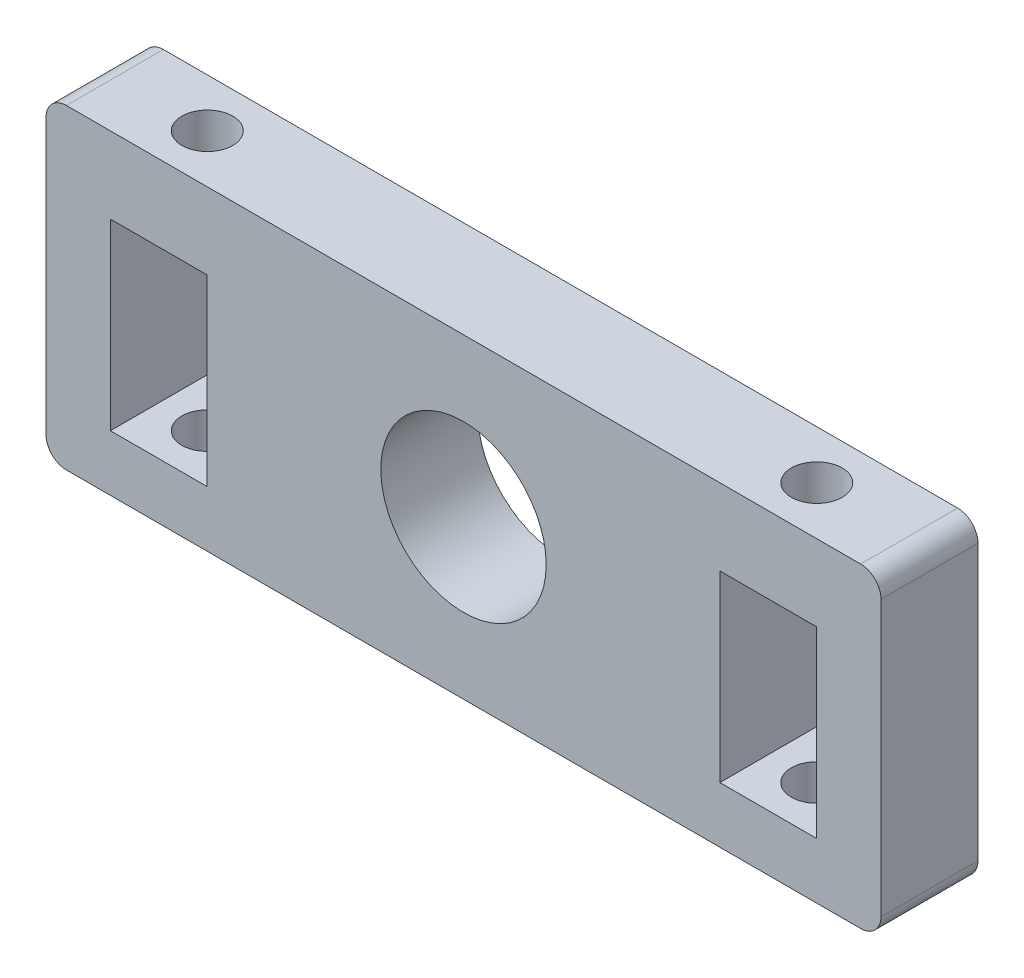
ISO-10303-21;
HEADER;
FILE_DESCRIPTION(('STEP AP214'),'2;1');
FILE_NAME('part.step','',(''),(''),'','','');
FILE_SCHEMA(('AUTOMOTIVE_DESIGN { 1 0 10303 214 1 1 1 1 }'));
ENDSEC;
DATA;
#1=APPLICATION_CONTEXT('core data for automotive mechanical design processes');
#2=APPLICATION_PROTOCOL_DEFINITION('international standard','automotive_design',2000,#1);
#3=PRODUCT_CONTEXT('',#1,'mechanical');
#4=PRODUCT('Part','Part','',(#3));
#5=PRODUCT_RELATED_PRODUCT_CATEGORY('part','',(#4));
#6=PRODUCT_DEFINITION_FORMATION('','',#4);
#7=PRODUCT_DEFINITION_CONTEXT('part definition',#1,'design');
#8=PRODUCT_DEFINITION('design','',#6,#7);
#9=PRODUCT_DEFINITION_SHAPE('','',#8);
#10=(LENGTH_UNIT() NAMED_UNIT(*) SI_UNIT(.MILLI.,.METRE.));
#11=(NAMED_UNIT(*) PLANE_ANGLE_UNIT() SI_UNIT($,.RADIAN.));
#12=(NAMED_UNIT(*) SI_UNIT($,.STERADIAN.) SOLID_ANGLE_UNIT());
#13=UNCERTAINTY_MEASURE_WITH_UNIT(LENGTH_MEASURE(1.E-05),#10,'distance_accuracy_value','');
#14=(GEOMETRIC_REPRESENTATION_CONTEXT(3) GLOBAL_UNCERTAINTY_ASSIGNED_CONTEXT((#13)) GLOBAL_UNIT_ASSIGNED_CONTEXT((#10,
#11,#12)) REPRESENTATION_CONTEXT('',''));
#15=CARTESIAN_POINT('',(0.,0.,0.));
#16=DIRECTION('',(0.,0.,1.));
#17=DIRECTION('',(1.,0.,0.));
#18=AXIS2_PLACEMENT_3D('',#15,#16,#17);
#19=CARTESIAN_POINT('',(0.,0.,9.525));
#20=DIRECTION('',(0.,0.,1.));
#21=DIRECTION('',(1.,0.,0.));
#22=AXIS2_PLACEMENT_3D('',#19,#20,#21);
#23=PLANE('',#22);
#24=DIRECTION('',(0.,-1.,0.));
#25=VECTOR('',#24,1.);
#26=CARTESIAN_POINT('',(34.675,23.5,9.525));
#27=LINE('',#26,#25);
#28=CARTESIAN_POINT('',(34.675,23.5,9.525));
#29=VERTEX_POINT('',#28);
#30=CARTESIAN_POINT('',(34.675,5.50000000000001,9.525));
#31=VERTEX_POINT('',#30);
#32=EDGE_CURVE('E202',#29,#31,#27,.T.);
#33=ORIENTED_EDGE('',*,*,#32,.T.);
#34=DIRECTION('',(-1.,0.,0.));
#35=VECTOR('',#34,1.);
#36=CARTESIAN_POINT('',(34.675,5.50000000000001,9.525));
#37=LINE('',#36,#35);
#38=CARTESIAN_POINT('',(25.175,5.50000000000001,9.525));
#39=VERTEX_POINT('',#38);
#40=EDGE_CURVE('E205',#31,#39,#37,.T.);
#41=ORIENTED_EDGE('',*,*,#40,.T.);
#42=DIRECTION('',(0.,1.,0.));
#43=VECTOR('',#42,1.);
#44=CARTESIAN_POINT('',(25.175,23.5,9.525));
#45=LINE('',#44,#43);
#46=CARTESIAN_POINT('',(25.175,23.5,9.525));
#47=VERTEX_POINT('',#46);
#48=EDGE_CURVE('E209',#39,#47,#45,.T.);
#49=ORIENTED_EDGE('',*,*,#48,.T.);
#50=DIRECTION('',(1.,0.,0.));
#51=VECTOR('',#50,1.);
#52=CARTESIAN_POINT('',(34.675,23.5,9.525));
#53=LINE('',#52,#51);
#54=EDGE_CURVE('E212',#47,#29,#53,.T.);
#55=ORIENTED_EDGE('',*,*,#54,.T.);
#56=EDGE_LOOP('',(#33,#41,#49,#55));
#57=FACE_BOUND('',#56,.T.);
#58=CARTESIAN_POINT('',(0.,15.5,9.525));
#59=DIRECTION('',(0.,0.,1.));
#60=DIRECTION('',(1.,0.,0.));
#61=AXIS2_PLACEMENT_3D('',#58,#59,#60);
#62=CIRCLE('',#61,8.11984981392876);
#63=CARTESIAN_POINT('',(8.11984981392876,15.5,9.525));
#64=VERTEX_POINT('',#63);
#65=EDGE_CURVE('E227',#64,#64,#62,.T.);
#66=ORIENTED_EDGE('',*,*,#65,.F.);
#67=EDGE_LOOP('',(#66));
#68=FACE_BOUND('',#67,.T.);
#69=DIRECTION('',(0.,-1.,0.));
#70=VECTOR('',#69,1.);
#71=CARTESIAN_POINT('',(-41.,31.,9.525));
#72=LINE('',#71,#70);
#73=CARTESIAN_POINT('',(-41.,29.,9.525));
#74=VERTEX_POINT('',#73);
#75=CARTESIAN_POINT('',(-41.,2.,9.525));
#76=VERTEX_POINT('',#75);
#77=EDGE_CURVE('E240',#74,#76,#72,.T.);
#78=ORIENTED_EDGE('',*,*,#77,.T.);
#79=CARTESIAN_POINT('',(-39.,2.,9.525));
#80=DIRECTION('',(0.,0.,1.));
#81=DIRECTION('',(1.,0.,0.));
#82=AXIS2_PLACEMENT_3D('',#79,#80,#81);
#83=CIRCLE('',#82,2.);
#84=CARTESIAN_POINT('',(-39.,0.,9.525));
#85=VERTEX_POINT('',#84);
#86=EDGE_CURVE('E287',#76,#85,#83,.T.);
#87=ORIENTED_EDGE('',*,*,#86,.T.);
#88=DIRECTION('',(1.,0.,0.));
#89=VECTOR('',#88,1.);
#90=CARTESIAN_POINT('',(-41.,0.,9.525));
#91=LINE('',#90,#89);
#92=CARTESIAN_POINT('',(39.,0.,9.525));
#93=VERTEX_POINT('',#92);
#94=EDGE_CURVE('E243',#85,#93,#91,.T.);
#95=ORIENTED_EDGE('',*,*,#94,.T.);
#96=CARTESIAN_POINT('',(39.,2.00000000000001,9.525));
#97=DIRECTION('',(0.,0.,1.));
#98=DIRECTION('',(1.,0.,0.));
#99=AXIS2_PLACEMENT_3D('',#96,#97,#98);
#100=CIRCLE('',#99,2.);
#101=CARTESIAN_POINT('',(41.,2.00000000000001,9.525));
#102=VERTEX_POINT('',#101);
#103=EDGE_CURVE('E285',#93,#102,#100,.T.);
#104=ORIENTED_EDGE('',*,*,#103,.T.);
#105=DIRECTION('',(0.,1.,0.));
#106=VECTOR('',#105,1.);
#107=CARTESIAN_POINT('',(41.,31.,9.525));
#108=LINE('',#107,#106);
#109=CARTESIAN_POINT('',(41.,29.,9.525));
#110=VERTEX_POINT('',#109);
#111=EDGE_CURVE('E247',#102,#110,#108,.T.);
#112=ORIENTED_EDGE('',*,*,#111,.T.);
#113=CARTESIAN_POINT('',(39.,29.,9.525));
#114=DIRECTION('',(0.,0.,1.));
#115=DIRECTION('',(1.,0.,0.));
#116=AXIS2_PLACEMENT_3D('',#113,#114,#115);
#117=CIRCLE('',#116,2.);
#118=CARTESIAN_POINT('',(39.,31.,9.525));
#119=VERTEX_POINT('',#118);
#120=EDGE_CURVE('E283',#110,#119,#117,.T.);
#121=ORIENTED_EDGE('',*,*,#120,.T.);
#122=DIRECTION('',(-1.,0.,0.));
#123=VECTOR('',#122,1.);
#124=CARTESIAN_POINT('',(-41.,31.,9.525));
#125=LINE('',#124,#123);
#126=CARTESIAN_POINT('',(-39.,31.,9.525));
#127=VERTEX_POINT('',#126);
#128=EDGE_CURVE('E250',#119,#127,#125,.T.);
#129=ORIENTED_EDGE('',*,*,#128,.T.);
#130=CARTESIAN_POINT('',(-39.,29.,9.525));
#131=DIRECTION('',(0.,0.,1.));
#132=DIRECTION('',(1.,0.,0.));
#133=AXIS2_PLACEMENT_3D('',#130,#131,#132);
#134=CIRCLE('',#133,2.);
#135=EDGE_CURVE('E281',#127,#74,#134,.T.);
#136=ORIENTED_EDGE('',*,*,#135,.T.);
#137=EDGE_LOOP('',(#78,#87,#95,#104,#112,#121,#129,#136));
#138=FACE_BOUND('',#137,.T.);
#139=DIRECTION('',(1.,0.,0.));
#140=VECTOR('',#139,1.);
#141=CARTESIAN_POINT('',(-34.675,5.50000000000001,9.525));
#142=LINE('',#141,#140);
#143=CARTESIAN_POINT('',(-34.675,5.50000000000001,9.525));
#144=VERTEX_POINT('',#143);
#145=CARTESIAN_POINT('',(-25.175,5.50000000000001,9.525));
#146=VERTEX_POINT('',#145);
#147=EDGE_CURVE('E169',#144,#146,#142,.T.);
#148=ORIENTED_EDGE('',*,*,#147,.F.);
#149=DIRECTION('',(0.,-1.,0.));
#150=VECTOR('',#149,1.);
#151=CARTESIAN_POINT('',(-34.675,23.5,9.525));
#152=LINE('',#151,#150);
#153=CARTESIAN_POINT('',(-34.675,23.5,9.525));
#154=VERTEX_POINT('',#153);
#155=EDGE_CURVE('E165',#154,#144,#152,.T.);
#156=ORIENTED_EDGE('',*,*,#155,.F.);
#157=DIRECTION('',(-1.,0.,0.));
#158=VECTOR('',#157,1.);
#159=CARTESIAN_POINT('',(-34.675,23.5,9.525));
#160=LINE('',#159,#158);
#161=CARTESIAN_POINT('',(-25.175,23.5,9.525));
#162=VERTEX_POINT('',#161);
#163=EDGE_CURVE('E156',#162,#154,#160,.T.);
#164=ORIENTED_EDGE('',*,*,#163,.F.);
#165=DIRECTION('',(0.,1.,0.));
#166=VECTOR('',#165,1.);
#167=CARTESIAN_POINT('',(-25.175,23.5,9.525));
#168=LINE('',#167,#166);
#169=EDGE_CURVE('E164',#146,#162,#168,.T.);
#170=ORIENTED_EDGE('',*,*,#169,.F.);
#171=EDGE_LOOP('',(#148,#156,#164,#170));
#172=FACE_BOUND('',#171,.T.);
#173=ADVANCED_FACE('F41',(#57,#68,#138,#172),#23,.T.);
#174=CARTESIAN_POINT('',(0.,0.,0.));
#175=DIRECTION('',(0.,0.,1.));
#176=DIRECTION('',(1.,0.,0.));
#177=AXIS2_PLACEMENT_3D('',#174,#175,#176);
#178=PLANE('',#177);
#179=DIRECTION('',(1.,0.,0.));
#180=VECTOR('',#179,1.);
#181=CARTESIAN_POINT('',(-41.,0.,0.));
#182=LINE('',#181,#180);
#183=CARTESIAN_POINT('',(-39.,0.,0.));
#184=VERTEX_POINT('',#183);
#185=CARTESIAN_POINT('',(39.,0.,0.));
#186=VERTEX_POINT('',#185);
#187=EDGE_CURVE('E256',#184,#186,#182,.T.);
#188=ORIENTED_EDGE('',*,*,#187,.F.);
#189=CARTESIAN_POINT('',(-39.,2.,0.));
#190=DIRECTION('',(0.,0.,1.));
#191=DIRECTION('',(1.,0.,0.));
#192=AXIS2_PLACEMENT_3D('',#189,#190,#191);
#193=CIRCLE('',#192,2.);
#194=CARTESIAN_POINT('',(-41.,2.,0.));
#195=VERTEX_POINT('',#194);
#196=EDGE_CURVE('E274',#184,#195,#193,.F.);
#197=ORIENTED_EDGE('',*,*,#196,.T.);
#198=DIRECTION('',(0.,-1.,0.));
#199=VECTOR('',#198,1.);
#200=CARTESIAN_POINT('',(-41.,31.,0.));
#201=LINE('',#200,#199);
#202=CARTESIAN_POINT('',(-41.,29.,0.));
#203=VERTEX_POINT('',#202);
#204=EDGE_CURVE('E237',#203,#195,#201,.T.);
#205=ORIENTED_EDGE('',*,*,#204,.F.);
#206=CARTESIAN_POINT('',(-39.,29.,0.));
#207=DIRECTION('',(0.,0.,1.));
#208=DIRECTION('',(1.,0.,0.));
#209=AXIS2_PLACEMENT_3D('',#206,#207,#208);
#210=CIRCLE('',#209,2.);
#211=CARTESIAN_POINT('',(-39.,31.,0.));
#212=VERTEX_POINT('',#211);
#213=EDGE_CURVE('E268',#203,#212,#210,.F.);
#214=ORIENTED_EDGE('',*,*,#213,.T.);
#215=DIRECTION('',(-1.,0.,0.));
#216=VECTOR('',#215,1.);
#217=CARTESIAN_POINT('',(-41.,31.,0.));
#218=LINE('',#217,#216);
#219=CARTESIAN_POINT('',(39.,31.,0.));
#220=VERTEX_POINT('',#219);
#221=EDGE_CURVE('E244',#220,#212,#218,.T.);
#222=ORIENTED_EDGE('',*,*,#221,.F.);
#223=CARTESIAN_POINT('',(39.,29.,0.));
#224=DIRECTION('',(0.,0.,1.));
#225=DIRECTION('',(1.,0.,0.));
#226=AXIS2_PLACEMENT_3D('',#223,#224,#225);
#227=CIRCLE('',#226,2.);
#228=CARTESIAN_POINT('',(41.,29.,0.));
#229=VERTEX_POINT('',#228);
#230=EDGE_CURVE('E270',#220,#229,#227,.F.);
#231=ORIENTED_EDGE('',*,*,#230,.T.);
#232=DIRECTION('',(0.,1.,0.));
#233=VECTOR('',#232,1.);
#234=CARTESIAN_POINT('',(41.,31.,0.));
#235=LINE('',#234,#233);
#236=CARTESIAN_POINT('',(41.,2.00000000000001,0.));
#237=VERTEX_POINT('',#236);
#238=EDGE_CURVE('E259',#237,#229,#235,.T.);
#239=ORIENTED_EDGE('',*,*,#238,.F.);
#240=CARTESIAN_POINT('',(39.,2.00000000000001,0.));
#241=DIRECTION('',(0.,0.,1.));
#242=DIRECTION('',(1.,0.,0.));
#243=AXIS2_PLACEMENT_3D('',#240,#241,#242);
#244=CIRCLE('',#243,2.);
#245=EDGE_CURVE('E272',#237,#186,#244,.F.);
#246=ORIENTED_EDGE('',*,*,#245,.T.);
#247=EDGE_LOOP('',(#188,#197,#205,#214,#222,#231,#239,#246));
#248=FACE_BOUND('',#247,.T.);
#249=CARTESIAN_POINT('',(0.,15.5,0.));
#250=DIRECTION('',(0.,0.,1.));
#251=DIRECTION('',(1.,0.,0.));
#252=AXIS2_PLACEMENT_3D('',#249,#250,#251);
#253=CIRCLE('',#252,8.11984981392876);
#254=CARTESIAN_POINT('',(8.11984981392876,15.5,0.));
#255=VERTEX_POINT('',#254);
#256=EDGE_CURVE('E234',#255,#255,#253,.T.);
#257=ORIENTED_EDGE('',*,*,#256,.T.);
#258=EDGE_LOOP('',(#257));
#259=FACE_BOUND('',#258,.T.);
#260=DIRECTION('',(-1.,0.,0.));
#261=VECTOR('',#260,1.);
#262=CARTESIAN_POINT('',(34.675,5.50000000000001,0.));
#263=LINE('',#262,#261);
#264=CARTESIAN_POINT('',(34.675,5.50000000000001,0.));
#265=VERTEX_POINT('',#264);
#266=CARTESIAN_POINT('',(25.175,5.50000000000001,0.));
#267=VERTEX_POINT('',#266);
#268=EDGE_CURVE('E217',#265,#267,#263,.T.);
#269=ORIENTED_EDGE('',*,*,#268,.F.);
#270=DIRECTION('',(0.,-1.,0.));
#271=VECTOR('',#270,1.);
#272=CARTESIAN_POINT('',(34.675,23.5,0.));
#273=LINE('',#272,#271);
#274=CARTESIAN_POINT('',(34.675,23.5,0.));
#275=VERTEX_POINT('',#274);
#276=EDGE_CURVE('E197',#275,#265,#273,.T.);
#277=ORIENTED_EDGE('',*,*,#276,.F.);
#278=DIRECTION('',(1.,0.,0.));
#279=VECTOR('',#278,1.);
#280=CARTESIAN_POINT('',(34.675,23.5,0.));
#281=LINE('',#280,#279);
#282=CARTESIAN_POINT('',(25.175,23.5,0.));
#283=VERTEX_POINT('',#282);
#284=EDGE_CURVE('E206',#283,#275,#281,.T.);
#285=ORIENTED_EDGE('',*,*,#284,.F.);
#286=DIRECTION('',(0.,1.,0.));
#287=VECTOR('',#286,1.);
#288=CARTESIAN_POINT('',(25.175,23.5,0.));
#289=LINE('',#288,#287);
#290=EDGE_CURVE('E220',#267,#283,#289,.T.);
#291=ORIENTED_EDGE('',*,*,#290,.F.);
#292=EDGE_LOOP('',(#269,#277,#285,#291));
#293=FACE_BOUND('',#292,.T.);
#294=DIRECTION('',(0.,-1.,0.));
#295=VECTOR('',#294,1.);
#296=CARTESIAN_POINT('',(-34.675,23.5,0.));
#297=LINE('',#296,#295);
#298=CARTESIAN_POINT('',(-34.675,23.5,0.));
#299=VERTEX_POINT('',#298);
#300=CARTESIAN_POINT('',(-34.675,5.50000000000001,0.));
#301=VERTEX_POINT('',#300);
#302=EDGE_CURVE('E66',#299,#301,#297,.T.);
#303=ORIENTED_EDGE('',*,*,#302,.T.);
#304=DIRECTION('',(1.,0.,0.));
#305=VECTOR('',#304,1.);
#306=CARTESIAN_POINT('',(-34.675,5.50000000000001,0.));
#307=LINE('',#306,#305);
#308=CARTESIAN_POINT('',(-25.175,5.50000000000001,0.));
#309=VERTEX_POINT('',#308);
#310=EDGE_CURVE('E172',#301,#309,#307,.T.);
#311=ORIENTED_EDGE('',*,*,#310,.T.);
#312=DIRECTION('',(0.,1.,0.));
#313=VECTOR('',#312,1.);
#314=CARTESIAN_POINT('',(-25.175,23.5,0.));
#315=LINE('',#314,#313);
#316=CARTESIAN_POINT('',(-25.175,23.5,0.));
#317=VERTEX_POINT('',#316);
#318=EDGE_CURVE('E175',#309,#317,#315,.T.);
#319=ORIENTED_EDGE('',*,*,#318,.T.);
#320=DIRECTION('',(-1.,0.,0.));
#321=VECTOR('',#320,1.);
#322=CARTESIAN_POINT('',(-34.675,23.5,0.));
#323=LINE('',#322,#321);
#324=EDGE_CURVE('E184',#317,#299,#323,.T.);
#325=ORIENTED_EDGE('',*,*,#324,.T.);
#326=EDGE_LOOP('',(#303,#311,#319,#325));
#327=FACE_BOUND('',#326,.T.);
#328=ADVANCED_FACE('F322',(#248,#259,#293,#327),#178,.F.);
#329=CARTESIAN_POINT('',(-29.925,1.,4.76));
#330=DIRECTION('',(0.,1.,0.));
#331=DIRECTION('',(-1.,0.,0.));
#332=AXIS2_PLACEMENT_3D('',#329,#330,#331);
#333=CYLINDRICAL_SURFACE('',#332,2.5);
#334=CARTESIAN_POINT('',(-29.925,31.,4.76));
#335=DIRECTION('',(0.,1.,0.));
#336=DIRECTION('',(-1.,0.,0.));
#337=AXIS2_PLACEMENT_3D('',#334,#335,#336);
#338=CIRCLE('',#337,2.5);
#339=CARTESIAN_POINT('',(-32.425,31.,4.76));
#340=VERTEX_POINT('',#339);
#341=EDGE_CURVE('E198',#340,#340,#338,.T.);
#342=ORIENTED_EDGE('',*,*,#341,.T.);
#343=EDGE_LOOP('',(#342));
#344=FACE_BOUND('',#343,.T.);
#345=CARTESIAN_POINT('',(-29.925,23.5,4.76));
#346=DIRECTION('',(0.,-1.,0.));
#347=DIRECTION('',(1.,0.,0.));
#348=AXIS2_PLACEMENT_3D('',#345,#346,#347);
#349=CIRCLE('',#348,2.5);
#350=CARTESIAN_POINT('',(-27.425,23.5,4.76));
#351=VERTEX_POINT('',#350);
#352=EDGE_CURVE('E190',#351,#351,#349,.F.);
#353=ORIENTED_EDGE('',*,*,#352,.F.);
#354=EDGE_LOOP('',(#353));
#355=FACE_BOUND('',#354,.T.);
#356=ADVANCED_FACE('F307',(#344,#355),#333,.F.);
#357=CARTESIAN_POINT('',(-41.,31.,9.525));
#358=DIRECTION('',(1.,0.,0.));
#359=DIRECTION('',(0.,1.,0.));
#360=AXIS2_PLACEMENT_3D('',#357,#358,#359);
#361=PLANE('',#360);
#362=ORIENTED_EDGE('',*,*,#204,.T.);
#363=DIRECTION('',(0.,0.,-1.));
#364=VECTOR('',#363,1.);
#365=CARTESIAN_POINT('',(-41.,2.,9.525));
#366=LINE('',#365,#364);
#367=EDGE_CURVE('E279',#195,#76,#366,.F.);
#368=ORIENTED_EDGE('',*,*,#367,.T.);
#369=ORIENTED_EDGE('',*,*,#77,.F.);
#370=DIRECTION('',(0.,0.,-1.));
#371=VECTOR('',#370,1.);
#372=CARTESIAN_POINT('',(-41.,29.,9.525));
#373=LINE('',#372,#371);
#374=EDGE_CURVE('E276',#74,#203,#373,.T.);
#375=ORIENTED_EDGE('',*,*,#374,.T.);
#376=EDGE_LOOP('',(#362,#368,#369,#375));
#377=FACE_BOUND('',#376,.T.);
#378=ADVANCED_FACE('F321',(#377),#361,.F.);
#379=CARTESIAN_POINT('',(-41.,0.,9.525));
#380=DIRECTION('',(0.,1.,0.));
#381=DIRECTION('',(-1.,0.,0.));
#382=AXIS2_PLACEMENT_3D('',#379,#380,#381);
#383=PLANE('',#382);
#384=ORIENTED_EDGE('',*,*,#94,.F.);
#385=DIRECTION('',(0.,0.,-1.));
#386=VECTOR('',#385,1.);
#387=CARTESIAN_POINT('',(-39.,0.,9.525));
#388=LINE('',#387,#386);
#389=EDGE_CURVE('E265',#85,#184,#388,.T.);
#390=ORIENTED_EDGE('',*,*,#389,.T.);
#391=ORIENTED_EDGE('',*,*,#187,.T.);
#392=DIRECTION('',(0.,0.,-1.));
#393=VECTOR('',#392,1.);
#394=CARTESIAN_POINT('',(39.,0.,9.525));
#395=LINE('',#394,#393);
#396=EDGE_CURVE('E253',#186,#93,#395,.F.);
#397=ORIENTED_EDGE('',*,*,#396,.T.);
#398=EDGE_LOOP('',(#384,#390,#391,#397));
#399=FACE_BOUND('',#398,.T.);
#400=ADVANCED_FACE('F345',(#399),#383,.F.);
#401=CARTESIAN_POINT('',(41.,31.,9.525));
#402=DIRECTION('',(-1.,0.,0.));
#403=DIRECTION('',(0.,-1.,0.));
#404=AXIS2_PLACEMENT_3D('',#401,#402,#403);
#405=PLANE('',#404);
#406=ORIENTED_EDGE('',*,*,#111,.F.);
#407=DIRECTION('',(0.,0.,-1.));
#408=VECTOR('',#407,1.);
#409=CARTESIAN_POINT('',(41.,2.00000000000001,9.525));
#410=LINE('',#409,#408);
#411=EDGE_CURVE('E291',#102,#237,#410,.T.);
#412=ORIENTED_EDGE('',*,*,#411,.T.);
#413=ORIENTED_EDGE('',*,*,#238,.T.);
#414=DIRECTION('',(0.,0.,-1.));
#415=VECTOR('',#414,1.);
#416=CARTESIAN_POINT('',(41.,29.,9.525));
#417=LINE('',#416,#415);
#418=EDGE_CURVE('E289',#229,#110,#417,.F.);
#419=ORIENTED_EDGE('',*,*,#418,.T.);
#420=EDGE_LOOP('',(#406,#412,#413,#419));
#421=FACE_BOUND('',#420,.T.);
#422=ADVANCED_FACE('F341',(#421),#405,.F.);
#423=CARTESIAN_POINT('',(-41.,31.,9.525));
#424=DIRECTION('',(0.,-1.,0.));
#425=DIRECTION('',(1.,0.,0.));
#426=AXIS2_PLACEMENT_3D('',#423,#424,#425);
#427=PLANE('',#426);
#428=CARTESIAN_POINT('',(29.925,31.,4.76));
#429=DIRECTION('',(0.,-1.,0.));
#430=DIRECTION('',(1.,0.,0.));
#431=AXIS2_PLACEMENT_3D('',#428,#429,#430);
#432=CIRCLE('',#431,2.5);
#433=CARTESIAN_POINT('',(32.425,31.,4.76));
#434=VERTEX_POINT('',#433);
#435=EDGE_CURVE('E537',#434,#434,#432,.T.);
#436=ORIENTED_EDGE('',*,*,#435,.T.);
#437=EDGE_LOOP('',(#436));
#438=FACE_BOUND('',#437,.T.);
#439=ORIENTED_EDGE('',*,*,#341,.F.);
#440=EDGE_LOOP('',(#439));
#441=FACE_BOUND('',#440,.T.);
#442=ORIENTED_EDGE('',*,*,#128,.F.);
#443=DIRECTION('',(0.,0.,-1.));
#444=VECTOR('',#443,1.);
#445=CARTESIAN_POINT('',(39.,31.,9.525));
#446=LINE('',#445,#444);
#447=EDGE_CURVE('E11',#119,#220,#446,.T.);
#448=ORIENTED_EDGE('',*,*,#447,.T.);
#449=ORIENTED_EDGE('',*,*,#221,.T.);
#450=DIRECTION('',(0.,0.,-1.));
#451=VECTOR('',#450,1.);
#452=CARTESIAN_POINT('',(-39.,31.,9.525));
#453=LINE('',#452,#451);
#454=EDGE_CURVE('E50',#212,#127,#453,.F.);
#455=ORIENTED_EDGE('',*,*,#454,.T.);
#456=EDGE_LOOP('',(#442,#448,#449,#455));
#457=FACE_BOUND('',#456,.T.);
#458=ADVANCED_FACE('F337',(#438,#441,#457),#427,.F.);
#459=CARTESIAN_POINT('',(-39.,2.,9.525));
#460=DIRECTION('',(0.,0.,-1.));
#461=DIRECTION('',(-1.,0.,0.));
#462=AXIS2_PLACEMENT_3D('',#459,#460,#461);
#463=CYLINDRICAL_SURFACE('',#462,2.);
#464=ORIENTED_EDGE('',*,*,#86,.F.);
#465=ORIENTED_EDGE('',*,*,#367,.F.);
#466=ORIENTED_EDGE('',*,*,#196,.F.);
#467=ORIENTED_EDGE('',*,*,#389,.F.);
#468=EDGE_LOOP('',(#464,#465,#466,#467));
#469=FACE_BOUND('',#468,.T.);
#470=ADVANCED_FACE('F340',(#469),#463,.T.);
#471=CARTESIAN_POINT('',(39.,2.00000000000001,9.525));
#472=DIRECTION('',(0.,0.,-1.));
#473=DIRECTION('',(-1.,0.,0.));
#474=AXIS2_PLACEMENT_3D('',#471,#472,#473);
#475=CYLINDRICAL_SURFACE('',#474,2.);
#476=ORIENTED_EDGE('',*,*,#103,.F.);
#477=ORIENTED_EDGE('',*,*,#396,.F.);
#478=ORIENTED_EDGE('',*,*,#245,.F.);
#479=ORIENTED_EDGE('',*,*,#411,.F.);
#480=EDGE_LOOP('',(#476,#477,#478,#479));
#481=FACE_BOUND('',#480,.T.);
#482=ADVANCED_FACE('F355',(#481),#475,.T.);
#483=CARTESIAN_POINT('',(39.,29.,9.525));
#484=DIRECTION('',(0.,0.,-1.));
#485=DIRECTION('',(-1.,0.,0.));
#486=AXIS2_PLACEMENT_3D('',#483,#484,#485);
#487=CYLINDRICAL_SURFACE('',#486,2.);
#488=ORIENTED_EDGE('',*,*,#120,.F.);
#489=ORIENTED_EDGE('',*,*,#418,.F.);
#490=ORIENTED_EDGE('',*,*,#230,.F.);
#491=ORIENTED_EDGE('',*,*,#447,.F.);
#492=EDGE_LOOP('',(#488,#489,#490,#491));
#493=FACE_BOUND('',#492,.T.);
#494=ADVANCED_FACE('F358',(#493),#487,.T.);
#495=CARTESIAN_POINT('',(-39.,29.,9.525));
#496=DIRECTION('',(0.,0.,-1.));
#497=DIRECTION('',(-1.,0.,0.));
#498=AXIS2_PLACEMENT_3D('',#495,#496,#497);
#499=CYLINDRICAL_SURFACE('',#498,2.);
#500=ORIENTED_EDGE('',*,*,#135,.F.);
#501=ORIENTED_EDGE('',*,*,#454,.F.);
#502=ORIENTED_EDGE('',*,*,#213,.F.);
#503=ORIENTED_EDGE('',*,*,#374,.F.);
#504=EDGE_LOOP('',(#500,#501,#502,#503));
#505=FACE_BOUND('',#504,.T.);
#506=ADVANCED_FACE('F43',(#505),#499,.T.);
#507=CARTESIAN_POINT('',(0.,15.5,0.));
#508=DIRECTION('',(0.,0.,1.));
#509=DIRECTION('',(1.,0.,0.));
#510=AXIS2_PLACEMENT_3D('',#507,#508,#509);
#511=CYLINDRICAL_SURFACE('',#510,8.11984981392876);
#512=ORIENTED_EDGE('',*,*,#256,.F.);
#513=EDGE_LOOP('',(#512));
#514=FACE_BOUND('',#513,.T.);
#515=ORIENTED_EDGE('',*,*,#65,.T.);
#516=EDGE_LOOP('',(#515));
#517=FACE_BOUND('',#516,.T.);
#518=ADVANCED_FACE('F334',(#514,#517),#511,.F.);
#519=CARTESIAN_POINT('',(34.675,23.5,9.525));
#520=DIRECTION('',(1.,0.,0.));
#521=DIRECTION('',(0.,1.,0.));
#522=AXIS2_PLACEMENT_3D('',#519,#520,#521);
#523=PLANE('',#522);
#524=ORIENTED_EDGE('',*,*,#276,.T.);
#525=DIRECTION('',(0.,0.,-1.));
#526=VECTOR('',#525,1.);
#527=CARTESIAN_POINT('',(34.675,5.50000000000001,9.525));
#528=LINE('',#527,#526);
#529=EDGE_CURVE('E215',#31,#265,#528,.T.);
#530=ORIENTED_EDGE('',*,*,#529,.F.);
#531=ORIENTED_EDGE('',*,*,#32,.F.);
#532=DIRECTION('',(0.,0.,-1.));
#533=VECTOR('',#532,1.);
#534=CARTESIAN_POINT('',(34.675,23.5,9.525));
#535=LINE('',#534,#533);
#536=EDGE_CURVE('E225',#29,#275,#535,.T.);
#537=ORIENTED_EDGE('',*,*,#536,.T.);
#538=EDGE_LOOP('',(#524,#530,#531,#537));
#539=FACE_BOUND('',#538,.T.);
#540=ADVANCED_FACE('F475',(#539),#523,.F.);
#541=CARTESIAN_POINT('',(34.675,23.5,9.525));
#542=DIRECTION('',(0.,1.,0.));
#543=DIRECTION('',(-1.,0.,0.));
#544=AXIS2_PLACEMENT_3D('',#541,#542,#543);
#545=PLANE('',#544);
#546=CARTESIAN_POINT('',(29.925,23.5,4.76));
#547=DIRECTION('',(0.,1.,0.));
#548=DIRECTION('',(-1.,0.,0.));
#549=AXIS2_PLACEMENT_3D('',#546,#547,#548);
#550=CIRCLE('',#549,2.5);
#551=CARTESIAN_POINT('',(27.425,23.5,4.76));
#552=VERTEX_POINT('',#551);
#553=EDGE_CURVE('E178',#552,#552,#550,.F.);
#554=ORIENTED_EDGE('',*,*,#553,.F.);
#555=EDGE_LOOP('',(#554));
#556=FACE_BOUND('',#555,.T.);
#557=ORIENTED_EDGE('',*,*,#284,.T.);
#558=ORIENTED_EDGE('',*,*,#536,.F.);
#559=ORIENTED_EDGE('',*,*,#54,.F.);
#560=DIRECTION('',(0.,0.,-1.));
#561=VECTOR('',#560,1.);
#562=CARTESIAN_POINT('',(25.175,23.5,9.525));
#563=LINE('',#562,#561);
#564=EDGE_CURVE('E228',#47,#283,#563,.T.);
#565=ORIENTED_EDGE('',*,*,#564,.T.);
#566=EDGE_LOOP('',(#557,#558,#559,#565));
#567=FACE_BOUND('',#566,.T.);
#568=ADVANCED_FACE('F470',(#556,#567),#545,.F.);
#569=CARTESIAN_POINT('',(25.175,23.5,9.525));
#570=DIRECTION('',(-1.,0.,0.));
#571=DIRECTION('',(0.,0.,1.));
#572=AXIS2_PLACEMENT_3D('',#569,#570,#571);
#573=PLANE('',#572);
#574=ORIENTED_EDGE('',*,*,#290,.T.);
#575=ORIENTED_EDGE('',*,*,#564,.F.);
#576=ORIENTED_EDGE('',*,*,#48,.F.);
#577=DIRECTION('',(0.,0.,-1.));
#578=VECTOR('',#577,1.);
#579=CARTESIAN_POINT('',(25.175,5.50000000000001,9.525));
#580=LINE('',#579,#578);
#581=EDGE_CURVE('E230',#39,#267,#580,.T.);
#582=ORIENTED_EDGE('',*,*,#581,.T.);
#583=EDGE_LOOP('',(#574,#575,#576,#582));
#584=FACE_BOUND('',#583,.T.);
#585=ADVANCED_FACE('F407',(#584),#573,.F.);
#586=CARTESIAN_POINT('',(34.675,5.50000000000001,9.525));
#587=DIRECTION('',(0.,-1.,0.));
#588=DIRECTION('',(0.,0.,-1.));
#589=AXIS2_PLACEMENT_3D('',#586,#587,#588);
#590=PLANE('',#589);
#591=CARTESIAN_POINT('',(29.925,5.50000000000001,4.76));
#592=DIRECTION('',(0.,-1.,0.));
#593=DIRECTION('',(0.,0.,-1.));
#594=AXIS2_PLACEMENT_3D('',#591,#592,#593);
#595=CIRCLE('',#594,2.5);
#596=CARTESIAN_POINT('',(29.925,5.50000000000001,2.26));
#597=VERTEX_POINT('',#596);
#598=EDGE_CURVE('E45',#597,#597,#595,.F.);
#599=ORIENTED_EDGE('',*,*,#598,.F.);
#600=EDGE_LOOP('',(#599));
#601=FACE_BOUND('',#600,.T.);
#602=ORIENTED_EDGE('',*,*,#268,.T.);
#603=ORIENTED_EDGE('',*,*,#581,.F.);
#604=ORIENTED_EDGE('',*,*,#40,.F.);
#605=ORIENTED_EDGE('',*,*,#529,.T.);
#606=EDGE_LOOP('',(#602,#603,#604,#605));
#607=FACE_BOUND('',#606,.T.);
#608=ADVANCED_FACE('F400',(#601,#607),#590,.F.);
#609=CARTESIAN_POINT('',(-34.675,5.50000000000001,9.525));
#610=DIRECTION('',(0.,1.,0.));
#611=DIRECTION('',(0.,0.,1.));
#612=AXIS2_PLACEMENT_3D('',#609,#610,#611);
#613=PLANE('',#612);
#614=ORIENTED_EDGE('',*,*,#310,.F.);
#615=DIRECTION('',(0.,0.,-1.));
#616=VECTOR('',#615,1.);
#617=CARTESIAN_POINT('',(-34.675,5.50000000000001,9.525));
#618=LINE('',#617,#616);
#619=EDGE_CURVE('E188',#144,#301,#618,.T.);
#620=ORIENTED_EDGE('',*,*,#619,.F.);
#621=ORIENTED_EDGE('',*,*,#147,.T.);
#622=DIRECTION('',(0.,0.,-1.));
#623=VECTOR('',#622,1.);
#624=CARTESIAN_POINT('',(-25.175,5.50000000000001,9.525));
#625=LINE('',#624,#623);
#626=EDGE_CURVE('E191',#146,#309,#625,.T.);
#627=ORIENTED_EDGE('',*,*,#626,.T.);
#628=EDGE_LOOP('',(#614,#620,#621,#627));
#629=FACE_BOUND('',#628,.T.);
#630=CARTESIAN_POINT('',(-29.925,5.50000000000001,4.76));
#631=DIRECTION('',(0.,1.,0.));
#632=DIRECTION('',(0.,0.,1.));
#633=AXIS2_PLACEMENT_3D('',#630,#631,#632);
#634=CIRCLE('',#633,2.5);
#635=CARTESIAN_POINT('',(-29.925,5.50000000000001,7.26));
#636=VERTEX_POINT('',#635);
#637=EDGE_CURVE('E201',#636,#636,#634,.F.);
#638=ORIENTED_EDGE('',*,*,#637,.T.);
#639=EDGE_LOOP('',(#638));
#640=FACE_BOUND('',#639,.T.);
#641=ADVANCED_FACE('F299',(#629,#640),#613,.T.);
#642=CARTESIAN_POINT('',(-34.675,23.5,9.525));
#643=DIRECTION('',(0.,-1.,0.));
#644=DIRECTION('',(1.,0.,0.));
#645=AXIS2_PLACEMENT_3D('',#642,#643,#644);
#646=PLANE('',#645);
#647=ORIENTED_EDGE('',*,*,#324,.F.);
#648=DIRECTION('',(0.,0.,-1.));
#649=VECTOR('',#648,1.);
#650=CARTESIAN_POINT('',(-25.175,23.5,9.525));
#651=LINE('',#650,#649);
#652=EDGE_CURVE('E58',#162,#317,#651,.T.);
#653=ORIENTED_EDGE('',*,*,#652,.F.);
#654=ORIENTED_EDGE('',*,*,#163,.T.);
#655=DIRECTION('',(0.,0.,-1.));
#656=VECTOR('',#655,1.);
#657=CARTESIAN_POINT('',(-34.675,23.5,9.525));
#658=LINE('',#657,#656);
#659=EDGE_CURVE('E159',#154,#299,#658,.T.);
#660=ORIENTED_EDGE('',*,*,#659,.T.);
#661=EDGE_LOOP('',(#647,#653,#654,#660));
#662=FACE_BOUND('',#661,.T.);
#663=ORIENTED_EDGE('',*,*,#352,.T.);
#664=EDGE_LOOP('',(#663));
#665=FACE_BOUND('',#664,.T.);
#666=ADVANCED_FACE('F157',(#662,#665),#646,.T.);
#667=CARTESIAN_POINT('',(-34.675,23.5,9.525));
#668=DIRECTION('',(1.,0.,0.));
#669=DIRECTION('',(0.,1.,0.));
#670=AXIS2_PLACEMENT_3D('',#667,#668,#669);
#671=PLANE('',#670);
#672=ORIENTED_EDGE('',*,*,#302,.F.);
#673=ORIENTED_EDGE('',*,*,#659,.F.);
#674=ORIENTED_EDGE('',*,*,#155,.T.);
#675=ORIENTED_EDGE('',*,*,#619,.T.);
#676=EDGE_LOOP('',(#672,#673,#674,#675));
#677=FACE_BOUND('',#676,.T.);
#678=ADVANCED_FACE('F167',(#677),#671,.T.);
#679=CARTESIAN_POINT('',(-25.175,23.5,9.525));
#680=DIRECTION('',(-1.,0.,0.));
#681=DIRECTION('',(0.,0.,1.));
#682=AXIS2_PLACEMENT_3D('',#679,#680,#681);
#683=PLANE('',#682);
#684=ORIENTED_EDGE('',*,*,#318,.F.);
#685=ORIENTED_EDGE('',*,*,#626,.F.);
#686=ORIENTED_EDGE('',*,*,#169,.T.);
#687=ORIENTED_EDGE('',*,*,#652,.T.);
#688=EDGE_LOOP('',(#684,#685,#686,#687));
#689=FACE_BOUND('',#688,.T.);
#690=ADVANCED_FACE('F315',(#689),#683,.T.);
#691=CARTESIAN_POINT('',(-29.925,1.,4.76));
#692=DIRECTION('',(0.,1.,0.));
#693=DIRECTION('',(-1.,0.,0.));
#694=AXIS2_PLACEMENT_3D('',#691,#692,#693);
#695=PLANE('',#694);
#696=CARTESIAN_POINT('',(-29.925,1.,4.76));
#697=DIRECTION('',(0.,1.,0.));
#698=DIRECTION('',(-1.,0.,0.));
#699=AXIS2_PLACEMENT_3D('',#696,#697,#698);
#700=CIRCLE('',#699,2.5);
#701=CARTESIAN_POINT('',(-32.425,1.,4.76));
#702=VERTEX_POINT('',#701);
#703=EDGE_CURVE('E194',#702,#702,#700,.T.);
#704=ORIENTED_EDGE('',*,*,#703,.T.);
#705=EDGE_LOOP('',(#704));
#706=FACE_BOUND('',#705,.T.);
#707=ADVANCED_FACE('F304',(#706),#695,.T.);
#708=ORIENTED_EDGE('',*,*,#703,.F.);
#709=EDGE_LOOP('',(#708));
#710=FACE_BOUND('',#709,.T.);
#711=ORIENTED_EDGE('',*,*,#637,.F.);
#712=EDGE_LOOP('',(#711));
#713=FACE_BOUND('',#712,.T.);
#714=ADVANCED_FACE('F301',(#710,#713),#333,.F.);
#715=CARTESIAN_POINT('',(29.925,1.,4.76));
#716=DIRECTION('',(0.,1.,0.));
#717=DIRECTION('',(1.,0.,0.));
#718=AXIS2_PLACEMENT_3D('',#715,#716,#717);
#719=PLANE('',#718);
#720=CARTESIAN_POINT('',(29.925,1.,4.76));
#721=DIRECTION('',(0.,-1.,0.));
#722=DIRECTION('',(1.,0.,0.));
#723=AXIS2_PLACEMENT_3D('',#720,#721,#722);
#724=CIRCLE('',#723,2.5);
#725=CARTESIAN_POINT('',(32.425,1.,4.76));
#726=VERTEX_POINT('',#725);
#727=EDGE_CURVE('E541',#726,#726,#724,.T.);
#728=ORIENTED_EDGE('',*,*,#727,.F.);
#729=EDGE_LOOP('',(#728));
#730=FACE_BOUND('',#729,.T.);
#731=ADVANCED_FACE('F303',(#730),#719,.T.);
#732=CARTESIAN_POINT('',(29.925,1.,4.76));
#733=DIRECTION('',(0.,1.,0.));
#734=DIRECTION('',(-1.,0.,0.));
#735=AXIS2_PLACEMENT_3D('',#732,#733,#734);
#736=CYLINDRICAL_SURFACE('',#735,2.5);
#737=ORIENTED_EDGE('',*,*,#727,.T.);
#738=EDGE_LOOP('',(#737));
#739=FACE_BOUND('',#738,.T.);
#740=ORIENTED_EDGE('',*,*,#598,.T.);
#741=EDGE_LOOP('',(#740));
#742=FACE_BOUND('',#741,.T.);
#743=ADVANCED_FACE('F312',(#739,#742),#736,.F.);
#744=ORIENTED_EDGE('',*,*,#435,.F.);
#745=EDGE_LOOP('',(#744));
#746=FACE_BOUND('',#745,.T.);
#747=ORIENTED_EDGE('',*,*,#553,.T.);
#748=EDGE_LOOP('',(#747));
#749=FACE_BOUND('',#748,.T.);
#750=ADVANCED_FACE('F412',(#746,#749),#736,.F.);
#751=CLOSED_SHELL('',(#173,#328,#356,#378,#400,#422,#458,#470,#482,#494,#506,#518,#540,#568,
#585,#608,#641,#666,#678,#690,#707,#714,#731,#743,#750));
#752=MANIFOLD_SOLID_BREP('B2',#751);
#753=ADVANCED_BREP_SHAPE_REPRESENTATION('',(#18,#752),#14);
#754=SHAPE_DEFINITION_REPRESENTATION(#9,#753);
ENDSEC;
END-ISO-10303-21;
